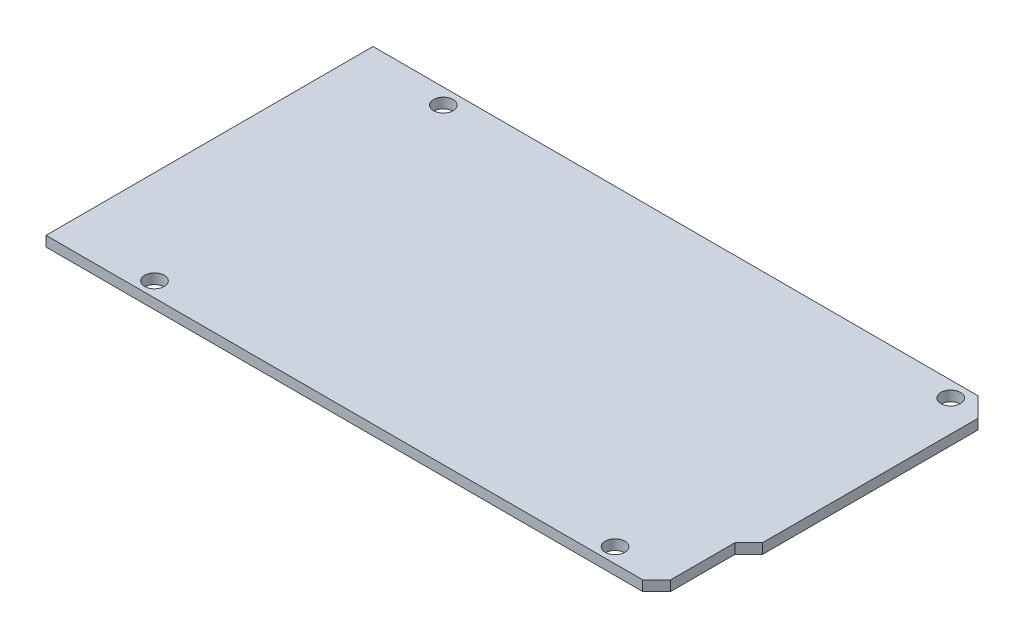
ISO-10303-21;
HEADER;
FILE_DESCRIPTION(('STEP AP214'),'2;1');
FILE_NAME('part.step','',(''),(''),'','','');
FILE_SCHEMA(('AUTOMOTIVE_DESIGN { 1 0 10303 214 1 1 1 1 }'));
ENDSEC;
DATA;
#1=APPLICATION_CONTEXT('core data for automotive mechanical design processes');
#2=APPLICATION_PROTOCOL_DEFINITION('international standard','automotive_design',2000,#1);
#3=PRODUCT_CONTEXT('',#1,'mechanical');
#4=PRODUCT('Part','Part','',(#3));
#5=PRODUCT_RELATED_PRODUCT_CATEGORY('part','',(#4));
#6=PRODUCT_DEFINITION_FORMATION('','',#4);
#7=PRODUCT_DEFINITION_CONTEXT('part definition',#1,'design');
#8=PRODUCT_DEFINITION('design','',#6,#7);
#9=PRODUCT_DEFINITION_SHAPE('','',#8);
#10=(LENGTH_UNIT() NAMED_UNIT(*) SI_UNIT(.MILLI.,.METRE.));
#11=(NAMED_UNIT(*) PLANE_ANGLE_UNIT() SI_UNIT($,.RADIAN.));
#12=(NAMED_UNIT(*) SI_UNIT($,.STERADIAN.) SOLID_ANGLE_UNIT());
#13=UNCERTAINTY_MEASURE_WITH_UNIT(LENGTH_MEASURE(1.E-05),#10,'distance_accuracy_value','');
#14=(GEOMETRIC_REPRESENTATION_CONTEXT(3) GLOBAL_UNCERTAINTY_ASSIGNED_CONTEXT((#13)) GLOBAL_UNIT_ASSIGNED_CONTEXT((#10,
#11,#12)) REPRESENTATION_CONTEXT('',''));
#15=CARTESIAN_POINT('',(0.,0.,0.));
#16=DIRECTION('',(0.,0.,1.));
#17=DIRECTION('',(1.,0.,0.));
#18=AXIS2_PLACEMENT_3D('',#15,#16,#17);
#19=CARTESIAN_POINT('',(0.,0.,0.));
#20=DIRECTION('',(0.,-1.,0.));
#21=DIRECTION('',(0.,0.,-1.));
#22=AXIS2_PLACEMENT_3D('',#19,#20,#21);
#23=PLANE('',#22);
#24=CARTESIAN_POINT('',(-35.56,0.,24.1935));
#25=DIRECTION('',(0.,-1.,0.));
#26=DIRECTION('',(0.,0.,-1.));
#27=AXIS2_PLACEMENT_3D('',#24,#25,#26);
#28=CIRCLE('',#27,1.5875);
#29=CARTESIAN_POINT('',(-35.56,0.,22.606));
#30=VERTEX_POINT('',#29);
#31=EDGE_CURVE('E19',#30,#30,#28,.F.);
#32=ORIENTED_EDGE('',*,*,#31,.T.);
#33=EDGE_LOOP('',(#32));
#34=FACE_BOUND('',#33,.T.);
#35=CARTESIAN_POINT('',(-36.83,0.,-24.0665));
#36=DIRECTION('',(0.,-1.,0.));
#37=DIRECTION('',(0.,0.,-1.));
#38=AXIS2_PLACEMENT_3D('',#35,#36,#37);
#39=CIRCLE('',#38,1.5875);
#40=CARTESIAN_POINT('',(-36.83,0.,-25.654));
#41=VERTEX_POINT('',#40);
#42=EDGE_CURVE('E122',#41,#41,#39,.F.);
#43=ORIENTED_EDGE('',*,*,#42,.T.);
#44=EDGE_LOOP('',(#43));
#45=FACE_BOUND('',#44,.T.);
#46=CARTESIAN_POINT('',(45.72,0.,-24.0665));
#47=DIRECTION('',(0.,-1.,0.));
#48=DIRECTION('',(0.,0.,-1.));
#49=AXIS2_PLACEMENT_3D('',#46,#47,#48);
#50=CIRCLE('',#49,1.5875);
#51=CARTESIAN_POINT('',(45.72,0.,-25.654));
#52=VERTEX_POINT('',#51);
#53=EDGE_CURVE('E120',#52,#52,#50,.F.);
#54=ORIENTED_EDGE('',*,*,#53,.T.);
#55=EDGE_LOOP('',(#54));
#56=FACE_BOUND('',#55,.T.);
#57=CARTESIAN_POINT('',(39.37,0.,24.1935));
#58=DIRECTION('',(0.,-1.,0.));
#59=DIRECTION('',(0.,0.,-1.));
#60=AXIS2_PLACEMENT_3D('',#57,#58,#59);
#61=CIRCLE('',#60,1.5875);
#62=CARTESIAN_POINT('',(39.37,0.,22.606));
#63=VERTEX_POINT('',#62);
#64=EDGE_CURVE('E117',#63,#63,#61,.F.);
#65=ORIENTED_EDGE('',*,*,#64,.T.);
#66=EDGE_LOOP('',(#65));
#67=FACE_BOUND('',#66,.T.);
#68=DIRECTION('',(-0.707106781186549,0.,0.707106781186546));
#69=VECTOR('',#68,1.);
#70=CARTESIAN_POINT('',(48.5548697692464,0.,13.8772331956146));
#71=LINE('',#70,#69);
#72=CARTESIAN_POINT('',(50.8,0.,11.632102964861));
#73=VERTEX_POINT('',#72);
#74=CARTESIAN_POINT('',(48.5548697692464,0.,13.8772331956146));
#75=VERTEX_POINT('',#74);
#76=EDGE_CURVE('E141',#73,#75,#71,.T.);
#77=ORIENTED_EDGE('',*,*,#76,.T.);
#78=DIRECTION('',(0.,0.,1.));
#79=VECTOR('',#78,1.);
#80=CARTESIAN_POINT('',(48.5548697692464,0.,26.6065));
#81=LINE('',#80,#79);
#82=CARTESIAN_POINT('',(48.5548697692464,0.,24.3205));
#83=VERTEX_POINT('',#82);
#84=EDGE_CURVE('E136',#75,#83,#81,.T.);
#85=ORIENTED_EDGE('',*,*,#84,.T.);
#86=DIRECTION('',(0.707106781186546,0.,-0.707106781186549));
#87=VECTOR('',#86,1.);
#88=CARTESIAN_POINT('',(47.4118697692464,0.,25.4635));
#89=LINE('',#88,#87);
#90=CARTESIAN_POINT('',(46.2688697692464,0.,26.6065));
#91=VERTEX_POINT('',#90);
#92=EDGE_CURVE('E96',#91,#83,#89,.T.);
#93=ORIENTED_EDGE('',*,*,#92,.F.);
#94=DIRECTION('',(1.,0.,0.));
#95=VECTOR('',#94,1.);
#96=CARTESIAN_POINT('',(-50.8,0.,26.6065));
#97=LINE('',#96,#95);
#98=CARTESIAN_POINT('',(-50.8,0.,26.6065));
#99=VERTEX_POINT('',#98);
#100=EDGE_CURVE('E92',#99,#91,#97,.T.);
#101=ORIENTED_EDGE('',*,*,#100,.F.);
#102=DIRECTION('',(0.,0.,1.));
#103=VECTOR('',#102,1.);
#104=CARTESIAN_POINT('',(-50.8,0.,-26.6065));
#105=LINE('',#104,#103);
#106=CARTESIAN_POINT('',(-50.8,0.,-26.6065));
#107=VERTEX_POINT('',#106);
#108=EDGE_CURVE('E83',#107,#99,#105,.T.);
#109=ORIENTED_EDGE('',*,*,#108,.F.);
#110=DIRECTION('',(-1.,0.,0.));
#111=VECTOR('',#110,1.);
#112=CARTESIAN_POINT('',(50.8,0.,-26.6065));
#113=LINE('',#112,#111);
#114=CARTESIAN_POINT('',(47.625,0.,-26.6065));
#115=VERTEX_POINT('',#114);
#116=EDGE_CURVE('E78',#115,#107,#113,.T.);
#117=ORIENTED_EDGE('',*,*,#116,.F.);
#118=DIRECTION('',(-0.707106781186546,0.,-0.707106781186549));
#119=VECTOR('',#118,1.);
#120=CARTESIAN_POINT('',(49.2125,0.,-25.019));
#121=LINE('',#120,#119);
#122=CARTESIAN_POINT('',(50.8,0.,-23.4315));
#123=VERTEX_POINT('',#122);
#124=EDGE_CURVE('E152',#123,#115,#121,.T.);
#125=ORIENTED_EDGE('',*,*,#124,.F.);
#126=DIRECTION('',(0.,0.,-1.));
#127=VECTOR('',#126,1.);
#128=CARTESIAN_POINT('',(50.8,0.,26.6065));
#129=LINE('',#128,#127);
#130=EDGE_CURVE('E148',#73,#123,#129,.T.);
#131=ORIENTED_EDGE('',*,*,#130,.F.);
#132=EDGE_LOOP('',(#77,#85,#93,#101,#109,#117,#125,#131));
#133=FACE_BOUND('',#132,.T.);
#134=ADVANCED_FACE('F16',(#34,#45,#56,#67,#133),#23,.T.);
#135=CARTESIAN_POINT('',(-50.8,0.,26.6065));
#136=DIRECTION('',(0.,0.,1.));
#137=DIRECTION('',(1.,0.,0.));
#138=AXIS2_PLACEMENT_3D('',#135,#136,#137);
#139=PLANE('',#138);
#140=DIRECTION('',(0.,1.,0.));
#141=VECTOR('',#140,1.);
#142=CARTESIAN_POINT('',(-50.8,0.,26.6065));
#143=LINE('',#142,#141);
#144=CARTESIAN_POINT('',(-50.8,1.651,26.6065));
#145=VERTEX_POINT('',#144);
#146=EDGE_CURVE('E88',#99,#145,#143,.T.);
#147=ORIENTED_EDGE('',*,*,#146,.F.);
#148=ORIENTED_EDGE('',*,*,#100,.T.);
#149=DIRECTION('',(0.,1.,0.));
#150=VECTOR('',#149,1.);
#151=CARTESIAN_POINT('',(46.2688697692464,0.8255,26.6065));
#152=LINE('',#151,#150);
#153=CARTESIAN_POINT('',(46.2688697692464,1.651,26.6065));
#154=VERTEX_POINT('',#153);
#155=EDGE_CURVE('E130',#154,#91,#152,.F.);
#156=ORIENTED_EDGE('',*,*,#155,.F.);
#157=DIRECTION('',(1.,0.,0.));
#158=VECTOR('',#157,1.);
#159=CARTESIAN_POINT('',(0.,1.651,26.6065));
#160=LINE('',#159,#158);
#161=EDGE_CURVE('E103',#154,#145,#160,.F.);
#162=ORIENTED_EDGE('',*,*,#161,.T.);
#163=EDGE_LOOP('',(#147,#148,#156,#162));
#164=FACE_BOUND('',#163,.T.);
#165=ADVANCED_FACE('F102',(#164),#139,.T.);
#166=CARTESIAN_POINT('',(-50.8,0.,-26.6065));
#167=DIRECTION('',(-1.,0.,0.));
#168=DIRECTION('',(0.,0.,1.));
#169=AXIS2_PLACEMENT_3D('',#166,#167,#168);
#170=PLANE('',#169);
#171=DIRECTION('',(0.,0.,-1.));
#172=VECTOR('',#171,1.);
#173=CARTESIAN_POINT('',(-50.8,1.651,0.));
#174=LINE('',#173,#172);
#175=CARTESIAN_POINT('',(-50.8,1.651,-26.6065));
#176=VERTEX_POINT('',#175);
#177=EDGE_CURVE('E161',#145,#176,#174,.T.);
#178=ORIENTED_EDGE('',*,*,#177,.T.);
#179=DIRECTION('',(0.,1.,0.));
#180=VECTOR('',#179,1.);
#181=CARTESIAN_POINT('',(-50.8,0.,-26.6065));
#182=LINE('',#181,#180);
#183=EDGE_CURVE('E90',#107,#176,#182,.T.);
#184=ORIENTED_EDGE('',*,*,#183,.F.);
#185=ORIENTED_EDGE('',*,*,#108,.T.);
#186=ORIENTED_EDGE('',*,*,#146,.T.);
#187=EDGE_LOOP('',(#178,#184,#185,#186));
#188=FACE_BOUND('',#187,.T.);
#189=ADVANCED_FACE('F86',(#188),#170,.T.);
#190=CARTESIAN_POINT('',(50.8,0.,-26.6065));
#191=DIRECTION('',(0.,0.,-1.));
#192=DIRECTION('',(-1.,0.,0.));
#193=AXIS2_PLACEMENT_3D('',#190,#191,#192);
#194=PLANE('',#193);
#195=ORIENTED_EDGE('',*,*,#183,.T.);
#196=DIRECTION('',(1.,0.,0.));
#197=VECTOR('',#196,1.);
#198=CARTESIAN_POINT('',(0.,1.651,-26.6065));
#199=LINE('',#198,#197);
#200=CARTESIAN_POINT('',(47.625,1.651,-26.6065));
#201=VERTEX_POINT('',#200);
#202=EDGE_CURVE('E156',#176,#201,#199,.T.);
#203=ORIENTED_EDGE('',*,*,#202,.T.);
#204=DIRECTION('',(0.,1.,0.));
#205=VECTOR('',#204,1.);
#206=CARTESIAN_POINT('',(47.625,0.,-26.6065));
#207=LINE('',#206,#205);
#208=EDGE_CURVE('E150',#115,#201,#207,.T.);
#209=ORIENTED_EDGE('',*,*,#208,.F.);
#210=ORIENTED_EDGE('',*,*,#116,.T.);
#211=EDGE_LOOP('',(#195,#203,#209,#210));
#212=FACE_BOUND('',#211,.T.);
#213=ADVANCED_FACE('F155',(#212),#194,.T.);
#214=CARTESIAN_POINT('',(49.2125,0.,-25.019));
#215=DIRECTION('',(0.707106781186549,0.,-0.707106781186546));
#216=DIRECTION('',(-0.707106781186546,0.,-0.707106781186549));
#217=AXIS2_PLACEMENT_3D('',#214,#215,#216);
#218=PLANE('',#217);
#219=ORIENTED_EDGE('',*,*,#124,.T.);
#220=ORIENTED_EDGE('',*,*,#208,.T.);
#221=DIRECTION('',(0.707106781186547,0.,0.707106781186548));
#222=VECTOR('',#221,1.);
#223=CARTESIAN_POINT('',(47.625,1.651,-26.6065));
#224=LINE('',#223,#222);
#225=CARTESIAN_POINT('',(50.8,1.651,-23.4315));
#226=VERTEX_POINT('',#225);
#227=EDGE_CURVE('E164',#201,#226,#224,.T.);
#228=ORIENTED_EDGE('',*,*,#227,.T.);
#229=DIRECTION('',(0.,1.,0.));
#230=VECTOR('',#229,1.);
#231=CARTESIAN_POINT('',(50.8,0.,-23.4315));
#232=LINE('',#231,#230);
#233=EDGE_CURVE('E146',#123,#226,#232,.T.);
#234=ORIENTED_EDGE('',*,*,#233,.F.);
#235=EDGE_LOOP('',(#219,#220,#228,#234));
#236=FACE_BOUND('',#235,.T.);
#237=ADVANCED_FACE('F190',(#236),#218,.T.);
#238=CARTESIAN_POINT('',(50.8,0.,26.6065));
#239=DIRECTION('',(1.,0.,0.));
#240=DIRECTION('',(0.,0.,-1.));
#241=AXIS2_PLACEMENT_3D('',#238,#239,#240);
#242=PLANE('',#241);
#243=ORIENTED_EDGE('',*,*,#233,.T.);
#244=DIRECTION('',(0.,0.,-1.));
#245=VECTOR('',#244,1.);
#246=CARTESIAN_POINT('',(50.8,1.651,0.));
#247=LINE('',#246,#245);
#248=CARTESIAN_POINT('',(50.8,1.651,11.632102964861));
#249=VERTEX_POINT('',#248);
#250=EDGE_CURVE('E168',#226,#249,#247,.F.);
#251=ORIENTED_EDGE('',*,*,#250,.T.);
#252=DIRECTION('',(0.,1.,0.));
#253=VECTOR('',#252,1.);
#254=CARTESIAN_POINT('',(50.8,1.651,11.632102964861));
#255=LINE('',#254,#253);
#256=EDGE_CURVE('E143',#249,#73,#255,.F.);
#257=ORIENTED_EDGE('',*,*,#256,.T.);
#258=ORIENTED_EDGE('',*,*,#130,.T.);
#259=EDGE_LOOP('',(#243,#251,#257,#258));
#260=FACE_BOUND('',#259,.T.);
#261=ADVANCED_FACE('F186',(#260),#242,.T.);
#262=CARTESIAN_POINT('',(48.5548697692464,1.651,13.8772331956146));
#263=DIRECTION('',(-0.707106781186546,0.,-0.707106781186549));
#264=DIRECTION('',(-0.707106781186549,0.,0.707106781186546));
#265=AXIS2_PLACEMENT_3D('',#262,#263,#264);
#266=PLANE('',#265);
#267=DIRECTION('',(0.,1.,0.));
#268=VECTOR('',#267,1.);
#269=CARTESIAN_POINT('',(48.5548697692464,1.651,13.8772331956146));
#270=LINE('',#269,#268);
#271=CARTESIAN_POINT('',(48.5548697692464,1.651,13.8772331956146));
#272=VERTEX_POINT('',#271);
#273=EDGE_CURVE('E138',#272,#75,#270,.F.);
#274=ORIENTED_EDGE('',*,*,#273,.T.);
#275=ORIENTED_EDGE('',*,*,#76,.F.);
#276=ORIENTED_EDGE('',*,*,#256,.F.);
#277=DIRECTION('',(-0.707106781186547,0.,0.707106781186547));
#278=VECTOR('',#277,1.);
#279=CARTESIAN_POINT('',(50.8,1.651,11.632102964861));
#280=LINE('',#279,#278);
#281=EDGE_CURVE('E171',#249,#272,#280,.T.);
#282=ORIENTED_EDGE('',*,*,#281,.T.);
#283=EDGE_LOOP('',(#274,#275,#276,#282));
#284=FACE_BOUND('',#283,.T.);
#285=ADVANCED_FACE('F184',(#284),#266,.F.);
#286=CARTESIAN_POINT('',(48.5548697692464,1.651,26.6065));
#287=DIRECTION('',(-1.,0.,0.));
#288=DIRECTION('',(0.,0.,1.));
#289=AXIS2_PLACEMENT_3D('',#286,#287,#288);
#290=PLANE('',#289);
#291=ORIENTED_EDGE('',*,*,#84,.F.);
#292=ORIENTED_EDGE('',*,*,#273,.F.);
#293=DIRECTION('',(0.,0.,-1.));
#294=VECTOR('',#293,1.);
#295=CARTESIAN_POINT('',(48.5548697692464,1.651,0.));
#296=LINE('',#295,#294);
#297=CARTESIAN_POINT('',(48.5548697692464,1.651,24.3205));
#298=VERTEX_POINT('',#297);
#299=EDGE_CURVE('E174',#272,#298,#296,.F.);
#300=ORIENTED_EDGE('',*,*,#299,.T.);
#301=DIRECTION('',(0.,1.,0.));
#302=VECTOR('',#301,1.);
#303=CARTESIAN_POINT('',(48.5548697692464,0.8255,24.3205));
#304=LINE('',#303,#302);
#305=EDGE_CURVE('E34',#83,#298,#304,.T.);
#306=ORIENTED_EDGE('',*,*,#305,.F.);
#307=EDGE_LOOP('',(#291,#292,#300,#306));
#308=FACE_BOUND('',#307,.T.);
#309=ADVANCED_FACE('F181',(#308),#290,.F.);
#310=CARTESIAN_POINT('',(47.4118697692464,0.8255,25.4635));
#311=DIRECTION('',(0.707106781186549,0.,0.707106781186546));
#312=DIRECTION('',(0.707106781186546,0.,-0.707106781186549));
#313=AXIS2_PLACEMENT_3D('',#310,#311,#312);
#314=PLANE('',#313);
#315=ORIENTED_EDGE('',*,*,#92,.T.);
#316=ORIENTED_EDGE('',*,*,#305,.T.);
#317=DIRECTION('',(-0.707106781186547,0.,0.707106781186547));
#318=VECTOR('',#317,1.);
#319=CARTESIAN_POINT('',(48.5548697692464,1.651,24.3205));
#320=LINE('',#319,#318);
#321=EDGE_CURVE('E116',#298,#154,#320,.T.);
#322=ORIENTED_EDGE('',*,*,#321,.T.);
#323=ORIENTED_EDGE('',*,*,#155,.T.);
#324=EDGE_LOOP('',(#315,#316,#322,#323));
#325=FACE_BOUND('',#324,.T.);
#326=ADVANCED_FACE('F177',(#325),#314,.T.);
#327=CARTESIAN_POINT('',(-35.56,1.651,24.1935));
#328=DIRECTION('',(0.,-1.,0.));
#329=DIRECTION('',(0.,0.,-1.));
#330=AXIS2_PLACEMENT_3D('',#327,#328,#329);
#331=CYLINDRICAL_SURFACE('',#330,1.5875);
#332=CARTESIAN_POINT('',(-35.56,1.651,24.1935));
#333=DIRECTION('',(0.,-1.,0.));
#334=DIRECTION('',(0.,0.,-1.));
#335=AXIS2_PLACEMENT_3D('',#332,#333,#334);
#336=CIRCLE('',#335,1.5875);
#337=CARTESIAN_POINT('',(-35.56,1.651,22.606));
#338=VERTEX_POINT('',#337);
#339=EDGE_CURVE('E113',#338,#338,#336,.F.);
#340=ORIENTED_EDGE('',*,*,#339,.T.);
#341=EDGE_LOOP('',(#340));
#342=FACE_BOUND('',#341,.T.);
#343=ORIENTED_EDGE('',*,*,#31,.F.);
#344=EDGE_LOOP('',(#343));
#345=FACE_BOUND('',#344,.T.);
#346=ADVANCED_FACE('F219',(#342,#345),#331,.F.);
#347=CARTESIAN_POINT('',(-36.83,1.651,-24.0665));
#348=DIRECTION('',(0.,-1.,0.));
#349=DIRECTION('',(0.,0.,-1.));
#350=AXIS2_PLACEMENT_3D('',#347,#348,#349);
#351=CYLINDRICAL_SURFACE('',#350,1.5875);
#352=CARTESIAN_POINT('',(-36.83,1.651,-24.0665));
#353=DIRECTION('',(0.,-1.,0.));
#354=DIRECTION('',(0.,0.,-1.));
#355=AXIS2_PLACEMENT_3D('',#352,#353,#354);
#356=CIRCLE('',#355,1.5875);
#357=CARTESIAN_POINT('',(-36.83,1.651,-25.654));
#358=VERTEX_POINT('',#357);
#359=EDGE_CURVE('E110',#358,#358,#356,.F.);
#360=ORIENTED_EDGE('',*,*,#359,.T.);
#361=EDGE_LOOP('',(#360));
#362=FACE_BOUND('',#361,.T.);
#363=ORIENTED_EDGE('',*,*,#42,.F.);
#364=EDGE_LOOP('',(#363));
#365=FACE_BOUND('',#364,.T.);
#366=ADVANCED_FACE('F215',(#362,#365),#351,.F.);
#367=CARTESIAN_POINT('',(45.72,1.651,-24.0665));
#368=DIRECTION('',(0.,-1.,0.));
#369=DIRECTION('',(0.,0.,-1.));
#370=AXIS2_PLACEMENT_3D('',#367,#368,#369);
#371=CYLINDRICAL_SURFACE('',#370,1.5875);
#372=CARTESIAN_POINT('',(45.72,1.651,-24.0665));
#373=DIRECTION('',(0.,-1.,0.));
#374=DIRECTION('',(0.,0.,-1.));
#375=AXIS2_PLACEMENT_3D('',#372,#373,#374);
#376=CIRCLE('',#375,1.5875);
#377=CARTESIAN_POINT('',(45.72,1.651,-25.654));
#378=VERTEX_POINT('',#377);
#379=EDGE_CURVE('E25',#378,#378,#376,.F.);
#380=ORIENTED_EDGE('',*,*,#379,.T.);
#381=EDGE_LOOP('',(#380));
#382=FACE_BOUND('',#381,.T.);
#383=ORIENTED_EDGE('',*,*,#53,.F.);
#384=EDGE_LOOP('',(#383));
#385=FACE_BOUND('',#384,.T.);
#386=ADVANCED_FACE('F207',(#382,#385),#371,.F.);
#387=CARTESIAN_POINT('',(39.37,1.651,24.1935));
#388=DIRECTION('',(0.,-1.,0.));
#389=DIRECTION('',(0.,0.,-1.));
#390=AXIS2_PLACEMENT_3D('',#387,#388,#389);
#391=CYLINDRICAL_SURFACE('',#390,1.5875);
#392=CARTESIAN_POINT('',(39.37,1.651,24.1935));
#393=DIRECTION('',(0.,-1.,0.));
#394=DIRECTION('',(0.,0.,-1.));
#395=AXIS2_PLACEMENT_3D('',#392,#393,#394);
#396=CIRCLE('',#395,1.5875);
#397=CARTESIAN_POINT('',(39.37,1.651,22.606));
#398=VERTEX_POINT('',#397);
#399=EDGE_CURVE('E11',#398,#398,#396,.F.);
#400=ORIENTED_EDGE('',*,*,#399,.T.);
#401=EDGE_LOOP('',(#400));
#402=FACE_BOUND('',#401,.T.);
#403=ORIENTED_EDGE('',*,*,#64,.F.);
#404=EDGE_LOOP('',(#403));
#405=FACE_BOUND('',#404,.T.);
#406=ADVANCED_FACE('F201',(#402,#405),#391,.F.);
#407=CARTESIAN_POINT('',(0.,1.651,0.));
#408=DIRECTION('',(0.,-1.,0.));
#409=DIRECTION('',(0.,0.,-1.));
#410=AXIS2_PLACEMENT_3D('',#407,#408,#409);
#411=PLANE('',#410);
#412=ORIENTED_EDGE('',*,*,#399,.F.);
#413=EDGE_LOOP('',(#412));
#414=FACE_BOUND('',#413,.T.);
#415=ORIENTED_EDGE('',*,*,#379,.F.);
#416=EDGE_LOOP('',(#415));
#417=FACE_BOUND('',#416,.T.);
#418=ORIENTED_EDGE('',*,*,#359,.F.);
#419=EDGE_LOOP('',(#418));
#420=FACE_BOUND('',#419,.T.);
#421=ORIENTED_EDGE('',*,*,#339,.F.);
#422=EDGE_LOOP('',(#421));
#423=FACE_BOUND('',#422,.T.);
#424=ORIENTED_EDGE('',*,*,#299,.F.);
#425=ORIENTED_EDGE('',*,*,#281,.F.);
#426=ORIENTED_EDGE('',*,*,#250,.F.);
#427=ORIENTED_EDGE('',*,*,#227,.F.);
#428=ORIENTED_EDGE('',*,*,#202,.F.);
#429=ORIENTED_EDGE('',*,*,#177,.F.);
#430=ORIENTED_EDGE('',*,*,#161,.F.);
#431=ORIENTED_EDGE('',*,*,#321,.F.);
#432=EDGE_LOOP('',(#424,#425,#426,#427,#428,#429,#430,#431));
#433=FACE_BOUND('',#432,.T.);
#434=ADVANCED_FACE('F160',(#414,#417,#420,#423,#433),#411,.F.);
#435=CLOSED_SHELL('',(#134,#165,#189,#213,#237,#261,#285,#309,#326,#346,#366,#386,#406,#434));
#436=MANIFOLD_SOLID_BREP('B1',#435);
#437=ADVANCED_BREP_SHAPE_REPRESENTATION('',(#18,#436),#14);
#438=SHAPE_DEFINITION_REPRESENTATION(#9,#437);
ENDSEC;
END-ISO-10303-21;
